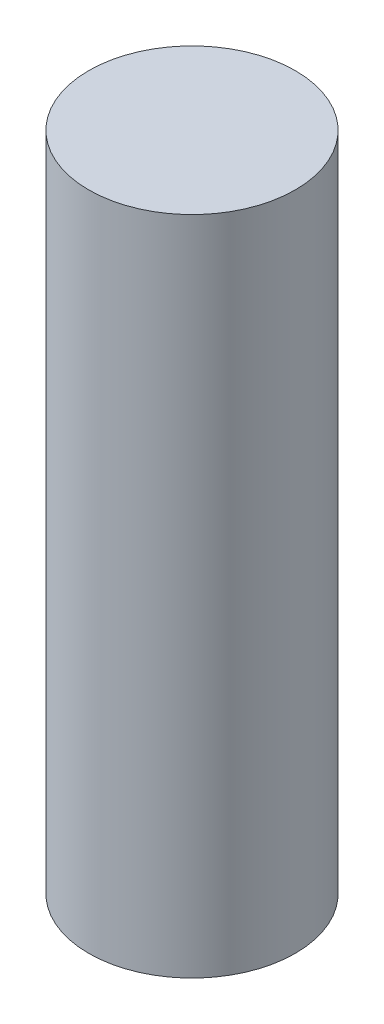
ISO-10303-21;
HEADER;
FILE_DESCRIPTION(('STEP AP214'),'2;1');
FILE_NAME('part.step','',(''),(''),'','','');
FILE_SCHEMA(('AUTOMOTIVE_DESIGN { 1 0 10303 214 1 1 1 1 }'));
ENDSEC;
DATA;
#1=APPLICATION_CONTEXT('core data for automotive mechanical design processes');
#2=APPLICATION_PROTOCOL_DEFINITION('international standard','automotive_design',2000,#1);
#3=PRODUCT_CONTEXT('',#1,'mechanical');
#4=PRODUCT('Part','Part','',(#3));
#5=PRODUCT_RELATED_PRODUCT_CATEGORY('part','',(#4));
#6=PRODUCT_DEFINITION_FORMATION('','',#4);
#7=PRODUCT_DEFINITION_CONTEXT('part definition',#1,'design');
#8=PRODUCT_DEFINITION('design','',#6,#7);
#9=PRODUCT_DEFINITION_SHAPE('','',#8);
#10=(LENGTH_UNIT() NAMED_UNIT(*) SI_UNIT(.MILLI.,.METRE.));
#11=(NAMED_UNIT(*) PLANE_ANGLE_UNIT() SI_UNIT($,.RADIAN.));
#12=(NAMED_UNIT(*) SI_UNIT($,.STERADIAN.) SOLID_ANGLE_UNIT());
#13=UNCERTAINTY_MEASURE_WITH_UNIT(LENGTH_MEASURE(1.E-05),#10,'distance_accuracy_value','');
#14=(GEOMETRIC_REPRESENTATION_CONTEXT(3) GLOBAL_UNCERTAINTY_ASSIGNED_CONTEXT((#13)) GLOBAL_UNIT_ASSIGNED_CONTEXT((#10,
#11,#12)) REPRESENTATION_CONTEXT('',''));
#15=CARTESIAN_POINT('',(0.,0.,0.));
#16=DIRECTION('',(0.,0.,1.));
#17=DIRECTION('',(1.,0.,0.));
#18=AXIS2_PLACEMENT_3D('',#15,#16,#17);
#19=CARTESIAN_POINT('',(0.,32.,0.));
#20=DIRECTION('',(0.,-1.,0.));
#21=DIRECTION('',(0.,0.,-1.));
#22=AXIS2_PLACEMENT_3D('',#19,#20,#21);
#23=CYLINDRICAL_SURFACE('',#22,5.);
#24=CARTESIAN_POINT('',(0.,32.,0.));
#25=DIRECTION('',(0.,1.,0.));
#26=DIRECTION('',(0.,0.,1.));
#27=AXIS2_PLACEMENT_3D('',#24,#25,#26);
#28=CIRCLE('',#27,5.);
#29=CARTESIAN_POINT('',(0.,32.,5.));
#30=VERTEX_POINT('',#29);
#31=EDGE_CURVE('E10',#30,#30,#28,.T.);
#32=ORIENTED_EDGE('',*,*,#31,.F.);
#33=EDGE_LOOP('',(#32));
#34=FACE_BOUND('',#33,.T.);
#35=CARTESIAN_POINT('',(0.,0.,0.));
#36=DIRECTION('',(0.,1.,0.));
#37=DIRECTION('',(0.,0.,1.));
#38=AXIS2_PLACEMENT_3D('',#35,#36,#37);
#39=CIRCLE('',#38,5.);
#40=CARTESIAN_POINT('',(0.,0.,5.));
#41=VERTEX_POINT('',#40);
#42=EDGE_CURVE('E33',#41,#41,#39,.T.);
#43=ORIENTED_EDGE('',*,*,#42,.T.);
#44=EDGE_LOOP('',(#43));
#45=FACE_BOUND('',#44,.T.);
#46=ADVANCED_FACE('F30',(#34,#45),#23,.T.);
#47=CARTESIAN_POINT('',(0.,32.,0.));
#48=DIRECTION('',(0.,1.,0.));
#49=DIRECTION('',(0.,0.,1.));
#50=AXIS2_PLACEMENT_3D('',#47,#48,#49);
#51=PLANE('',#50);
#52=ORIENTED_EDGE('',*,*,#31,.T.);
#53=EDGE_LOOP('',(#52));
#54=FACE_BOUND('',#53,.T.);
#55=ADVANCED_FACE('F45',(#54),#51,.T.);
#56=CARTESIAN_POINT('',(0.,0.,0.));
#57=DIRECTION('',(0.,1.,0.));
#58=DIRECTION('',(0.,0.,1.));
#59=AXIS2_PLACEMENT_3D('',#56,#57,#58);
#60=PLANE('',#59);
#61=ORIENTED_EDGE('',*,*,#42,.F.);
#62=EDGE_LOOP('',(#61));
#63=FACE_BOUND('',#62,.T.);
#64=ADVANCED_FACE('F43',(#63),#60,.F.);
#65=CLOSED_SHELL('',(#46,#55,#64));
#66=MANIFOLD_SOLID_BREP('B2',#65);
#67=ADVANCED_BREP_SHAPE_REPRESENTATION('',(#18,#66),#14);
#68=SHAPE_DEFINITION_REPRESENTATION(#9,#67);
ENDSEC;
END-ISO-10303-21;
